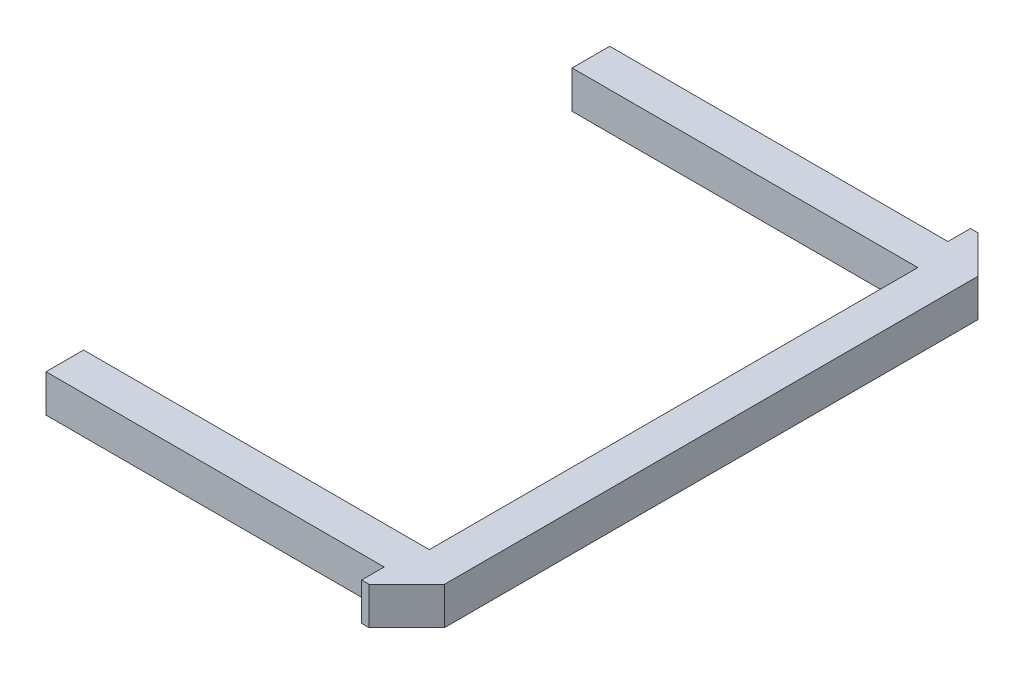
ISO-10303-21;
HEADER;
FILE_DESCRIPTION(('STEP AP214'),'2;1');
FILE_NAME('part.step','',(''),(''),'','','');
FILE_SCHEMA(('AUTOMOTIVE_DESIGN { 1 0 10303 214 1 1 1 1 }'));
ENDSEC;
DATA;
#1=APPLICATION_CONTEXT('core data for automotive mechanical design processes');
#2=APPLICATION_PROTOCOL_DEFINITION('international standard','automotive_design',2000,#1);
#3=PRODUCT_CONTEXT('',#1,'mechanical');
#4=PRODUCT('Part','Part','',(#3));
#5=PRODUCT_RELATED_PRODUCT_CATEGORY('part','',(#4));
#6=PRODUCT_DEFINITION_FORMATION('','',#4);
#7=PRODUCT_DEFINITION_CONTEXT('part definition',#1,'design');
#8=PRODUCT_DEFINITION('design','',#6,#7);
#9=PRODUCT_DEFINITION_SHAPE('','',#8);
#10=(LENGTH_UNIT() NAMED_UNIT(*) SI_UNIT(.MILLI.,.METRE.));
#11=(NAMED_UNIT(*) PLANE_ANGLE_UNIT() SI_UNIT($,.RADIAN.));
#12=(NAMED_UNIT(*) SI_UNIT($,.STERADIAN.) SOLID_ANGLE_UNIT());
#13=UNCERTAINTY_MEASURE_WITH_UNIT(LENGTH_MEASURE(1.E-05),#10,'distance_accuracy_value','');
#14=(GEOMETRIC_REPRESENTATION_CONTEXT(3) GLOBAL_UNCERTAINTY_ASSIGNED_CONTEXT((#13)) GLOBAL_UNIT_ASSIGNED_CONTEXT((#10,
#11,#12)) REPRESENTATION_CONTEXT('',''));
#15=CARTESIAN_POINT('',(0.,0.,0.));
#16=DIRECTION('',(0.,0.,1.));
#17=DIRECTION('',(1.,0.,0.));
#18=AXIS2_PLACEMENT_3D('',#15,#16,#17);
#19=CARTESIAN_POINT('',(38.2771038453607,5.,125.655523587223));
#20=DIRECTION('',(1.,0.,0.));
#21=DIRECTION('',(0.,0.,-1.));
#22=AXIS2_PLACEMENT_3D('',#19,#20,#21);
#23=PLANE('',#22);
#24=DIRECTION('',(0.,0.,1.));
#25=VECTOR('',#24,1.);
#26=CARTESIAN_POINT('',(38.2771038453607,0.,125.655523587223));
#27=LINE('',#26,#25);
#28=CARTESIAN_POINT('',(38.2771038453607,0.,125.655523587223));
#29=VERTEX_POINT('',#28);
#30=CARTESIAN_POINT('',(38.2771038453607,0.,130.655523587223));
#31=VERTEX_POINT('',#30);
#32=EDGE_CURVE('E166',#29,#31,#27,.T.);
#33=ORIENTED_EDGE('',*,*,#32,.T.);
#34=DIRECTION('',(0.,-1.,0.));
#35=VECTOR('',#34,1.);
#36=CARTESIAN_POINT('',(38.2771038453607,5.,130.655523587223));
#37=LINE('',#36,#35);
#38=CARTESIAN_POINT('',(38.2771038453607,5.,130.655523587223));
#39=VERTEX_POINT('',#38);
#40=EDGE_CURVE('E11',#39,#31,#37,.T.);
#41=ORIENTED_EDGE('',*,*,#40,.F.);
#42=DIRECTION('',(0.,0.,1.));
#43=VECTOR('',#42,1.);
#44=CARTESIAN_POINT('',(38.2771038453607,5.,125.655523587223));
#45=LINE('',#44,#43);
#46=CARTESIAN_POINT('',(38.2771038453607,5.,125.655523587223));
#47=VERTEX_POINT('',#46);
#48=EDGE_CURVE('E201',#47,#39,#45,.T.);
#49=ORIENTED_EDGE('',*,*,#48,.F.);
#50=DIRECTION('',(0.,-1.,0.));
#51=VECTOR('',#50,1.);
#52=CARTESIAN_POINT('',(38.2771038453607,5.,125.655523587223));
#53=LINE('',#52,#51);
#54=EDGE_CURVE('E49',#47,#29,#53,.T.);
#55=ORIENTED_EDGE('',*,*,#54,.T.);
#56=EDGE_LOOP('',(#33,#41,#49,#55));
#57=FACE_BOUND('',#56,.T.);
#58=ADVANCED_FACE('F33',(#57),#23,.F.);
#59=CARTESIAN_POINT('',(38.2771038453607,5.,130.655523587223));
#60=DIRECTION('',(0.,0.,-1.));
#61=DIRECTION('',(-1.,0.,0.));
#62=AXIS2_PLACEMENT_3D('',#59,#60,#61);
#63=PLANE('',#62);
#64=DIRECTION('',(1.,0.,0.));
#65=VECTOR('',#64,1.);
#66=CARTESIAN_POINT('',(38.2771038453607,0.,130.655523587223));
#67=LINE('',#66,#65);
#68=CARTESIAN_POINT('',(84.2771038453607,0.,130.655523587223));
#69=VERTEX_POINT('',#68);
#70=EDGE_CURVE('E168',#31,#69,#67,.T.);
#71=ORIENTED_EDGE('',*,*,#70,.T.);
#72=DIRECTION('',(0.,-1.,0.));
#73=VECTOR('',#72,1.);
#74=CARTESIAN_POINT('',(84.2771038453607,5.,130.655523587223));
#75=LINE('',#74,#73);
#76=CARTESIAN_POINT('',(84.2771038453607,5.,130.655523587223));
#77=VERTEX_POINT('',#76);
#78=EDGE_CURVE('E41',#77,#69,#75,.T.);
#79=ORIENTED_EDGE('',*,*,#78,.F.);
#80=DIRECTION('',(1.,0.,0.));
#81=VECTOR('',#80,1.);
#82=CARTESIAN_POINT('',(38.2771038453607,5.,130.655523587223));
#83=LINE('',#82,#81);
#84=EDGE_CURVE('E105',#39,#77,#83,.T.);
#85=ORIENTED_EDGE('',*,*,#84,.F.);
#86=ORIENTED_EDGE('',*,*,#40,.T.);
#87=EDGE_LOOP('',(#71,#79,#85,#86));
#88=FACE_BOUND('',#87,.T.);
#89=ADVANCED_FACE('F277',(#88),#63,.F.);
#90=CARTESIAN_POINT('',(84.2771038453607,5.,130.655523587223));
#91=DIRECTION('',(1.,0.,0.));
#92=DIRECTION('',(0.,0.,-1.));
#93=AXIS2_PLACEMENT_3D('',#90,#91,#92);
#94=PLANE('',#93);
#95=DIRECTION('',(0.,0.,1.));
#96=VECTOR('',#95,1.);
#97=CARTESIAN_POINT('',(84.2771038453607,0.,130.655523587223));
#98=LINE('',#97,#96);
#99=CARTESIAN_POINT('',(84.2771038453607,0.,195.655523587223));
#100=VERTEX_POINT('',#99);
#101=EDGE_CURVE('E170',#69,#100,#98,.T.);
#102=ORIENTED_EDGE('',*,*,#101,.T.);
#103=DIRECTION('',(0.,-1.,0.));
#104=VECTOR('',#103,1.);
#105=CARTESIAN_POINT('',(84.2771038453607,5.,195.655523587223));
#106=LINE('',#105,#104);
#107=CARTESIAN_POINT('',(84.2771038453607,5.,195.655523587223));
#108=VERTEX_POINT('',#107);
#109=EDGE_CURVE('E220',#108,#100,#106,.T.);
#110=ORIENTED_EDGE('',*,*,#109,.F.);
#111=DIRECTION('',(0.,0.,1.));
#112=VECTOR('',#111,1.);
#113=CARTESIAN_POINT('',(84.2771038453607,5.,130.655523587223));
#114=LINE('',#113,#112);
#115=EDGE_CURVE('E228',#77,#108,#114,.T.);
#116=ORIENTED_EDGE('',*,*,#115,.F.);
#117=ORIENTED_EDGE('',*,*,#78,.T.);
#118=EDGE_LOOP('',(#102,#110,#116,#117));
#119=FACE_BOUND('',#118,.T.);
#120=ADVANCED_FACE('F226',(#119),#94,.F.);
#121=CARTESIAN_POINT('',(84.2771038453607,5.,195.655523587223));
#122=DIRECTION('',(0.,0.,1.));
#123=DIRECTION('',(1.,0.,0.));
#124=AXIS2_PLACEMENT_3D('',#121,#122,#123);
#125=PLANE('',#124);
#126=DIRECTION('',(-1.,0.,0.));
#127=VECTOR('',#126,1.);
#128=CARTESIAN_POINT('',(84.2771038453607,0.,195.655523587223));
#129=LINE('',#128,#127);
#130=CARTESIAN_POINT('',(38.2771038453607,0.,195.655523587223));
#131=VERTEX_POINT('',#130);
#132=EDGE_CURVE('E172',#100,#131,#129,.T.);
#133=ORIENTED_EDGE('',*,*,#132,.T.);
#134=DIRECTION('',(0.,-1.,0.));
#135=VECTOR('',#134,1.);
#136=CARTESIAN_POINT('',(38.2771038453607,5.,195.655523587223));
#137=LINE('',#136,#135);
#138=CARTESIAN_POINT('',(38.2771038453607,5.,195.655523587223));
#139=VERTEX_POINT('',#138);
#140=EDGE_CURVE('E217',#139,#131,#137,.T.);
#141=ORIENTED_EDGE('',*,*,#140,.F.);
#142=DIRECTION('',(-1.,0.,0.));
#143=VECTOR('',#142,1.);
#144=CARTESIAN_POINT('',(84.2771038453607,5.,195.655523587223));
#145=LINE('',#144,#143);
#146=EDGE_CURVE('E245',#108,#139,#145,.T.);
#147=ORIENTED_EDGE('',*,*,#146,.F.);
#148=ORIENTED_EDGE('',*,*,#109,.T.);
#149=EDGE_LOOP('',(#133,#141,#147,#148));
#150=FACE_BOUND('',#149,.T.);
#151=ADVANCED_FACE('F235',(#150),#125,.F.);
#152=CARTESIAN_POINT('',(38.2771038453607,5.,195.655523587223));
#153=DIRECTION('',(1.,0.,0.));
#154=DIRECTION('',(0.,0.,-1.));
#155=AXIS2_PLACEMENT_3D('',#152,#153,#154);
#156=PLANE('',#155);
#157=DIRECTION('',(0.,0.,1.));
#158=VECTOR('',#157,1.);
#159=CARTESIAN_POINT('',(38.2771038453607,0.,195.655523587223));
#160=LINE('',#159,#158);
#161=CARTESIAN_POINT('',(38.2771038453607,0.,200.655523587223));
#162=VERTEX_POINT('',#161);
#163=EDGE_CURVE('E174',#131,#162,#160,.T.);
#164=ORIENTED_EDGE('',*,*,#163,.T.);
#165=DIRECTION('',(0.,-1.,0.));
#166=VECTOR('',#165,1.);
#167=CARTESIAN_POINT('',(38.2771038453607,5.,200.655523587223));
#168=LINE('',#167,#166);
#169=CARTESIAN_POINT('',(38.2771038453607,5.,200.655523587223));
#170=VERTEX_POINT('',#169);
#171=EDGE_CURVE('E215',#170,#162,#168,.T.);
#172=ORIENTED_EDGE('',*,*,#171,.F.);
#173=DIRECTION('',(0.,0.,1.));
#174=VECTOR('',#173,1.);
#175=CARTESIAN_POINT('',(38.2771038453607,5.,195.655523587223));
#176=LINE('',#175,#174);
#177=EDGE_CURVE('E241',#139,#170,#176,.T.);
#178=ORIENTED_EDGE('',*,*,#177,.F.);
#179=ORIENTED_EDGE('',*,*,#140,.T.);
#180=EDGE_LOOP('',(#164,#172,#178,#179));
#181=FACE_BOUND('',#180,.T.);
#182=ADVANCED_FACE('F239',(#181),#156,.F.);
#183=CARTESIAN_POINT('',(83.2771038453607,5.,200.655523587223));
#184=DIRECTION('',(0.,0.,1.));
#185=DIRECTION('',(1.,0.,0.));
#186=AXIS2_PLACEMENT_3D('',#183,#184,#185);
#187=PLANE('',#186);
#188=DIRECTION('',(-1.,0.,0.));
#189=VECTOR('',#188,1.);
#190=CARTESIAN_POINT('',(83.2771038453607,0.,200.655523587223));
#191=LINE('',#190,#189);
#192=CARTESIAN_POINT('',(83.2771038453607,0.,200.655523587223));
#193=VERTEX_POINT('',#192);
#194=EDGE_CURVE('E177',#193,#162,#191,.T.);
#195=ORIENTED_EDGE('',*,*,#194,.F.);
#196=DIRECTION('',(0.,-1.,0.));
#197=VECTOR('',#196,1.);
#198=CARTESIAN_POINT('',(83.2771038453607,5.,200.655523587223));
#199=LINE('',#198,#197);
#200=CARTESIAN_POINT('',(83.2771038453607,5.,200.655523587223));
#201=VERTEX_POINT('',#200);
#202=EDGE_CURVE('E213',#201,#193,#199,.T.);
#203=ORIENTED_EDGE('',*,*,#202,.F.);
#204=DIRECTION('',(-1.,0.,0.));
#205=VECTOR('',#204,1.);
#206=CARTESIAN_POINT('',(83.2771038453607,5.,200.655523587223));
#207=LINE('',#206,#205);
#208=EDGE_CURVE('E244',#201,#170,#207,.T.);
#209=ORIENTED_EDGE('',*,*,#208,.T.);
#210=ORIENTED_EDGE('',*,*,#171,.T.);
#211=EDGE_LOOP('',(#195,#203,#209,#210));
#212=FACE_BOUND('',#211,.T.);
#213=ADVANCED_FACE('F293',(#212),#187,.T.);
#214=CARTESIAN_POINT('',(83.2771038453607,5.,203.655523587223));
#215=DIRECTION('',(-1.,0.,0.));
#216=DIRECTION('',(0.,0.,1.));
#217=AXIS2_PLACEMENT_3D('',#214,#215,#216);
#218=PLANE('',#217);
#219=DIRECTION('',(0.,0.,-1.));
#220=VECTOR('',#219,1.);
#221=CARTESIAN_POINT('',(83.2771038453607,0.,203.655523587223));
#222=LINE('',#221,#220);
#223=CARTESIAN_POINT('',(83.2771038453607,0.,203.655523587223));
#224=VERTEX_POINT('',#223);
#225=EDGE_CURVE('E180',#224,#193,#222,.T.);
#226=ORIENTED_EDGE('',*,*,#225,.F.);
#227=DIRECTION('',(0.,-1.,0.));
#228=VECTOR('',#227,1.);
#229=CARTESIAN_POINT('',(83.2771038453607,5.,203.655523587223));
#230=LINE('',#229,#228);
#231=CARTESIAN_POINT('',(83.2771038453607,5.,203.655523587223));
#232=VERTEX_POINT('',#231);
#233=EDGE_CURVE('E211',#232,#224,#230,.T.);
#234=ORIENTED_EDGE('',*,*,#233,.F.);
#235=DIRECTION('',(0.,0.,-1.));
#236=VECTOR('',#235,1.);
#237=CARTESIAN_POINT('',(83.2771038453607,5.,203.655523587223));
#238=LINE('',#237,#236);
#239=EDGE_CURVE('E247',#232,#201,#238,.T.);
#240=ORIENTED_EDGE('',*,*,#239,.T.);
#241=ORIENTED_EDGE('',*,*,#202,.T.);
#242=EDGE_LOOP('',(#226,#234,#240,#241));
#243=FACE_BOUND('',#242,.T.);
#244=ADVANCED_FACE('F296',(#243),#218,.T.);
#245=CARTESIAN_POINT('',(84.2771038453607,5.,203.655523587223));
#246=DIRECTION('',(0.,0.,1.));
#247=DIRECTION('',(1.,0.,0.));
#248=AXIS2_PLACEMENT_3D('',#245,#246,#247);
#249=PLANE('',#248);
#250=DIRECTION('',(-1.,0.,0.));
#251=VECTOR('',#250,1.);
#252=CARTESIAN_POINT('',(84.2771038453607,0.,203.655523587223));
#253=LINE('',#252,#251);
#254=CARTESIAN_POINT('',(84.2771038453607,0.,203.655523587223));
#255=VERTEX_POINT('',#254);
#256=EDGE_CURVE('E183',#255,#224,#253,.T.);
#257=ORIENTED_EDGE('',*,*,#256,.F.);
#258=DIRECTION('',(0.,-1.,0.));
#259=VECTOR('',#258,1.);
#260=CARTESIAN_POINT('',(84.2771038453607,5.,203.655523587223));
#261=LINE('',#260,#259);
#262=CARTESIAN_POINT('',(84.2771038453607,5.,203.655523587223));
#263=VERTEX_POINT('',#262);
#264=EDGE_CURVE('E209',#263,#255,#261,.T.);
#265=ORIENTED_EDGE('',*,*,#264,.F.);
#266=DIRECTION('',(-1.,0.,0.));
#267=VECTOR('',#266,1.);
#268=CARTESIAN_POINT('',(84.2771038453607,5.,203.655523587223));
#269=LINE('',#268,#267);
#270=EDGE_CURVE('E254',#263,#232,#269,.T.);
#271=ORIENTED_EDGE('',*,*,#270,.T.);
#272=ORIENTED_EDGE('',*,*,#233,.T.);
#273=EDGE_LOOP('',(#257,#265,#271,#272));
#274=FACE_BOUND('',#273,.T.);
#275=ADVANCED_FACE('F300',(#274),#249,.T.);
#276=CARTESIAN_POINT('',(89.2771038453607,5.,198.655523587223));
#277=DIRECTION('',(0.707106781186546,0.,0.707106781186549));
#278=DIRECTION('',(0.707106781186549,0.,-0.707106781186546));
#279=AXIS2_PLACEMENT_3D('',#276,#277,#278);
#280=PLANE('',#279);
#281=DIRECTION('',(-0.707106781186549,0.,0.707106781186546));
#282=VECTOR('',#281,1.);
#283=CARTESIAN_POINT('',(89.2771038453607,0.,198.655523587223));
#284=LINE('',#283,#282);
#285=CARTESIAN_POINT('',(89.2771038453607,0.,198.655523587223));
#286=VERTEX_POINT('',#285);
#287=EDGE_CURVE('E186',#286,#255,#284,.T.);
#288=ORIENTED_EDGE('',*,*,#287,.F.);
#289=DIRECTION('',(0.,-1.,0.));
#290=VECTOR('',#289,1.);
#291=CARTESIAN_POINT('',(89.2771038453607,5.,198.655523587223));
#292=LINE('',#291,#290);
#293=CARTESIAN_POINT('',(89.2771038453607,5.,198.655523587223));
#294=VERTEX_POINT('',#293);
#295=EDGE_CURVE('E207',#294,#286,#292,.T.);
#296=ORIENTED_EDGE('',*,*,#295,.F.);
#297=DIRECTION('',(-0.707106781186549,0.,0.707106781186546));
#298=VECTOR('',#297,1.);
#299=CARTESIAN_POINT('',(89.2771038453607,5.,198.655523587223));
#300=LINE('',#299,#298);
#301=EDGE_CURVE('E257',#294,#263,#300,.T.);
#302=ORIENTED_EDGE('',*,*,#301,.T.);
#303=ORIENTED_EDGE('',*,*,#264,.T.);
#304=EDGE_LOOP('',(#288,#296,#302,#303));
#305=FACE_BOUND('',#304,.T.);
#306=ADVANCED_FACE('F304',(#305),#280,.T.);
#307=CARTESIAN_POINT('',(89.2771038453607,5.,127.655523587223));
#308=DIRECTION('',(1.,0.,0.));
#309=DIRECTION('',(0.,0.,-1.));
#310=AXIS2_PLACEMENT_3D('',#307,#308,#309);
#311=PLANE('',#310);
#312=DIRECTION('',(0.,0.,1.));
#313=VECTOR('',#312,1.);
#314=CARTESIAN_POINT('',(89.2771038453607,0.,127.655523587223));
#315=LINE('',#314,#313);
#316=CARTESIAN_POINT('',(89.2771038453607,0.,127.655523587223));
#317=VERTEX_POINT('',#316);
#318=EDGE_CURVE('E189',#317,#286,#315,.T.);
#319=ORIENTED_EDGE('',*,*,#318,.F.);
#320=DIRECTION('',(0.,-1.,0.));
#321=VECTOR('',#320,1.);
#322=CARTESIAN_POINT('',(89.2771038453607,5.,127.655523587223));
#323=LINE('',#322,#321);
#324=CARTESIAN_POINT('',(89.2771038453607,5.,127.655523587223));
#325=VERTEX_POINT('',#324);
#326=EDGE_CURVE('E205',#325,#317,#323,.T.);
#327=ORIENTED_EDGE('',*,*,#326,.F.);
#328=DIRECTION('',(0.,0.,1.));
#329=VECTOR('',#328,1.);
#330=CARTESIAN_POINT('',(89.2771038453607,5.,127.655523587223));
#331=LINE('',#330,#329);
#332=EDGE_CURVE('E260',#325,#294,#331,.T.);
#333=ORIENTED_EDGE('',*,*,#332,.T.);
#334=ORIENTED_EDGE('',*,*,#295,.T.);
#335=EDGE_LOOP('',(#319,#327,#333,#334));
#336=FACE_BOUND('',#335,.T.);
#337=ADVANCED_FACE('F308',(#336),#311,.T.);
#338=CARTESIAN_POINT('',(84.2771038453607,5.,122.655523587223));
#339=DIRECTION('',(0.707106781186548,0.,-0.707106781186548));
#340=DIRECTION('',(-0.707106781186548,0.,-0.707106781186548));
#341=AXIS2_PLACEMENT_3D('',#338,#339,#340);
#342=PLANE('',#341);
#343=DIRECTION('',(0.707106781186547,0.,0.707106781186547));
#344=VECTOR('',#343,1.);
#345=CARTESIAN_POINT('',(84.2771038453607,0.,122.655523587223));
#346=LINE('',#345,#344);
#347=CARTESIAN_POINT('',(84.2771038453607,0.,122.655523587223));
#348=VERTEX_POINT('',#347);
#349=EDGE_CURVE('E192',#348,#317,#346,.T.);
#350=ORIENTED_EDGE('',*,*,#349,.F.);
#351=DIRECTION('',(0.,-1.,0.));
#352=VECTOR('',#351,1.);
#353=CARTESIAN_POINT('',(84.2771038453607,5.,122.655523587223));
#354=LINE('',#353,#352);
#355=CARTESIAN_POINT('',(84.2771038453607,5.,122.655523587223));
#356=VERTEX_POINT('',#355);
#357=EDGE_CURVE('E148',#356,#348,#354,.T.);
#358=ORIENTED_EDGE('',*,*,#357,.F.);
#359=DIRECTION('',(0.707106781186547,0.,0.707106781186547));
#360=VECTOR('',#359,1.);
#361=CARTESIAN_POINT('',(84.2771038453607,5.,122.655523587223));
#362=LINE('',#361,#360);
#363=EDGE_CURVE('E158',#356,#325,#362,.T.);
#364=ORIENTED_EDGE('',*,*,#363,.T.);
#365=ORIENTED_EDGE('',*,*,#326,.T.);
#366=EDGE_LOOP('',(#350,#358,#364,#365));
#367=FACE_BOUND('',#366,.T.);
#368=ADVANCED_FACE('F264',(#367),#342,.T.);
#369=CARTESIAN_POINT('',(83.2771038453607,5.,122.655523587223));
#370=DIRECTION('',(0.,0.,-1.));
#371=DIRECTION('',(-1.,0.,0.));
#372=AXIS2_PLACEMENT_3D('',#369,#370,#371);
#373=PLANE('',#372);
#374=DIRECTION('',(1.,0.,0.));
#375=VECTOR('',#374,1.);
#376=CARTESIAN_POINT('',(83.2771038453607,0.,122.655523587223));
#377=LINE('',#376,#375);
#378=CARTESIAN_POINT('',(83.2771038453607,0.,122.655523587223));
#379=VERTEX_POINT('',#378);
#380=EDGE_CURVE('E144',#379,#348,#377,.T.);
#381=ORIENTED_EDGE('',*,*,#380,.F.);
#382=DIRECTION('',(0.,-1.,0.));
#383=VECTOR('',#382,1.);
#384=CARTESIAN_POINT('',(83.2771038453607,5.,122.655523587223));
#385=LINE('',#384,#383);
#386=CARTESIAN_POINT('',(83.2771038453607,5.,122.655523587223));
#387=VERTEX_POINT('',#386);
#388=EDGE_CURVE('E139',#387,#379,#385,.T.);
#389=ORIENTED_EDGE('',*,*,#388,.F.);
#390=DIRECTION('',(1.,0.,0.));
#391=VECTOR('',#390,1.);
#392=CARTESIAN_POINT('',(83.2771038453607,5.,122.655523587223));
#393=LINE('',#392,#391);
#394=EDGE_CURVE('E142',#387,#356,#393,.T.);
#395=ORIENTED_EDGE('',*,*,#394,.T.);
#396=ORIENTED_EDGE('',*,*,#357,.T.);
#397=EDGE_LOOP('',(#381,#389,#395,#396));
#398=FACE_BOUND('',#397,.T.);
#399=ADVANCED_FACE('F141',(#398),#373,.T.);
#400=CARTESIAN_POINT('',(83.2771038453607,5.,125.655523587223));
#401=DIRECTION('',(-1.,0.,0.));
#402=DIRECTION('',(0.,0.,1.));
#403=AXIS2_PLACEMENT_3D('',#400,#401,#402);
#404=PLANE('',#403);
#405=DIRECTION('',(0.,0.,-1.));
#406=VECTOR('',#405,1.);
#407=CARTESIAN_POINT('',(83.2771038453607,0.,125.655523587223));
#408=LINE('',#407,#406);
#409=CARTESIAN_POINT('',(83.2771038453607,0.,125.655523587223));
#410=VERTEX_POINT('',#409);
#411=EDGE_CURVE('E196',#410,#379,#408,.T.);
#412=ORIENTED_EDGE('',*,*,#411,.F.);
#413=DIRECTION('',(0.,-1.,0.));
#414=VECTOR('',#413,1.);
#415=CARTESIAN_POINT('',(83.2771038453607,5.,125.655523587223));
#416=LINE('',#415,#414);
#417=CARTESIAN_POINT('',(83.2771038453607,5.,125.655523587223));
#418=VERTEX_POINT('',#417);
#419=EDGE_CURVE('E93',#418,#410,#416,.T.);
#420=ORIENTED_EDGE('',*,*,#419,.F.);
#421=DIRECTION('',(0.,0.,-1.));
#422=VECTOR('',#421,1.);
#423=CARTESIAN_POINT('',(83.2771038453607,5.,125.655523587223));
#424=LINE('',#423,#422);
#425=EDGE_CURVE('E155',#418,#387,#424,.T.);
#426=ORIENTED_EDGE('',*,*,#425,.T.);
#427=ORIENTED_EDGE('',*,*,#388,.T.);
#428=EDGE_LOOP('',(#412,#420,#426,#427));
#429=FACE_BOUND('',#428,.T.);
#430=ADVANCED_FACE('F160',(#429),#404,.T.);
#431=CARTESIAN_POINT('',(38.2771038453607,5.,125.655523587223));
#432=DIRECTION('',(0.,0.,-1.));
#433=DIRECTION('',(-1.,0.,0.));
#434=AXIS2_PLACEMENT_3D('',#431,#432,#433);
#435=PLANE('',#434);
#436=DIRECTION('',(1.,0.,0.));
#437=VECTOR('',#436,1.);
#438=CARTESIAN_POINT('',(38.2771038453607,0.,125.655523587223));
#439=LINE('',#438,#437);
#440=EDGE_CURVE('E198',#29,#410,#439,.T.);
#441=ORIENTED_EDGE('',*,*,#440,.F.);
#442=ORIENTED_EDGE('',*,*,#54,.F.);
#443=DIRECTION('',(1.,0.,0.));
#444=VECTOR('',#443,1.);
#445=CARTESIAN_POINT('',(38.2771038453607,5.,125.655523587223));
#446=LINE('',#445,#444);
#447=EDGE_CURVE('E161',#47,#418,#446,.T.);
#448=ORIENTED_EDGE('',*,*,#447,.T.);
#449=ORIENTED_EDGE('',*,*,#419,.T.);
#450=EDGE_LOOP('',(#441,#442,#448,#449));
#451=FACE_BOUND('',#450,.T.);
#452=ADVANCED_FACE('F266',(#451),#435,.T.);
#453=CARTESIAN_POINT('',(0.,5.,0.));
#454=DIRECTION('',(0.,1.,0.));
#455=DIRECTION('',(0.,0.,1.));
#456=AXIS2_PLACEMENT_3D('',#453,#454,#455);
#457=PLANE('',#456);
#458=ORIENTED_EDGE('',*,*,#48,.T.);
#459=ORIENTED_EDGE('',*,*,#84,.T.);
#460=ORIENTED_EDGE('',*,*,#115,.T.);
#461=ORIENTED_EDGE('',*,*,#146,.T.);
#462=ORIENTED_EDGE('',*,*,#177,.T.);
#463=ORIENTED_EDGE('',*,*,#208,.F.);
#464=ORIENTED_EDGE('',*,*,#239,.F.);
#465=ORIENTED_EDGE('',*,*,#270,.F.);
#466=ORIENTED_EDGE('',*,*,#301,.F.);
#467=ORIENTED_EDGE('',*,*,#332,.F.);
#468=ORIENTED_EDGE('',*,*,#363,.F.);
#469=ORIENTED_EDGE('',*,*,#394,.F.);
#470=ORIENTED_EDGE('',*,*,#425,.F.);
#471=ORIENTED_EDGE('',*,*,#447,.F.);
#472=EDGE_LOOP('',(#458,#459,#460,#461,#462,#463,#464,#465,#466,#467,#468,#469,#470,#471));
#473=FACE_BOUND('',#472,.T.);
#474=ADVANCED_FACE('F153',(#473),#457,.T.);
#475=CARTESIAN_POINT('',(0.,0.,0.));
#476=DIRECTION('',(0.,1.,0.));
#477=DIRECTION('',(0.,0.,1.));
#478=AXIS2_PLACEMENT_3D('',#475,#476,#477);
#479=PLANE('',#478);
#480=ORIENTED_EDGE('',*,*,#32,.F.);
#481=ORIENTED_EDGE('',*,*,#440,.T.);
#482=ORIENTED_EDGE('',*,*,#411,.T.);
#483=ORIENTED_EDGE('',*,*,#380,.T.);
#484=ORIENTED_EDGE('',*,*,#349,.T.);
#485=ORIENTED_EDGE('',*,*,#318,.T.);
#486=ORIENTED_EDGE('',*,*,#287,.T.);
#487=ORIENTED_EDGE('',*,*,#256,.T.);
#488=ORIENTED_EDGE('',*,*,#225,.T.);
#489=ORIENTED_EDGE('',*,*,#194,.T.);
#490=ORIENTED_EDGE('',*,*,#163,.F.);
#491=ORIENTED_EDGE('',*,*,#132,.F.);
#492=ORIENTED_EDGE('',*,*,#101,.F.);
#493=ORIENTED_EDGE('',*,*,#70,.F.);
#494=EDGE_LOOP('',(#480,#481,#482,#483,#484,#485,#486,#487,#488,#489,#490,#491,#492,#493));
#495=FACE_BOUND('',#494,.T.);
#496=ADVANCED_FACE('F231',(#495),#479,.F.);
#497=CLOSED_SHELL('',(#58,#89,#120,#151,#182,#213,#244,#275,#306,#337,#368,#399,#430,#452,#474,#496));
#498=MANIFOLD_SOLID_BREP('B2',#497);
#499=ADVANCED_BREP_SHAPE_REPRESENTATION('',(#18,#498),#14);
#500=SHAPE_DEFINITION_REPRESENTATION(#9,#499);
ENDSEC;
END-ISO-10303-21;
